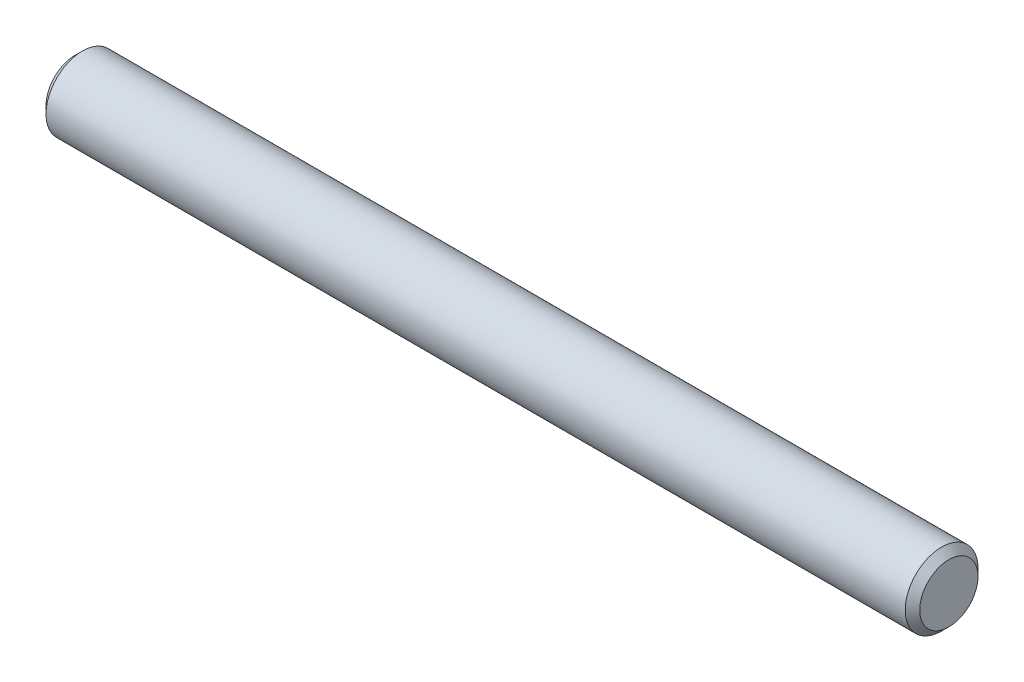
ISO-10303-21;
HEADER;
FILE_DESCRIPTION(('STEP AP214'),'2;1');
FILE_NAME('part.step','',(''),(''),'','','');
FILE_SCHEMA(('AUTOMOTIVE_DESIGN { 1 0 10303 214 1 1 1 1 }'));
ENDSEC;
DATA;
#1=APPLICATION_CONTEXT('core data for automotive mechanical design processes');
#2=APPLICATION_PROTOCOL_DEFINITION('international standard','automotive_design',2000,#1);
#3=PRODUCT_CONTEXT('',#1,'mechanical');
#4=PRODUCT('Part','Part','',(#3));
#5=PRODUCT_RELATED_PRODUCT_CATEGORY('part','',(#4));
#6=PRODUCT_DEFINITION_FORMATION('','',#4);
#7=PRODUCT_DEFINITION_CONTEXT('part definition',#1,'design');
#8=PRODUCT_DEFINITION('design','',#6,#7);
#9=PRODUCT_DEFINITION_SHAPE('','',#8);
#10=(LENGTH_UNIT() NAMED_UNIT(*) SI_UNIT(.MILLI.,.METRE.));
#11=(NAMED_UNIT(*) PLANE_ANGLE_UNIT() SI_UNIT($,.RADIAN.));
#12=(NAMED_UNIT(*) SI_UNIT($,.STERADIAN.) SOLID_ANGLE_UNIT());
#13=UNCERTAINTY_MEASURE_WITH_UNIT(LENGTH_MEASURE(1.E-05),#10,'distance_accuracy_value','');
#14=(GEOMETRIC_REPRESENTATION_CONTEXT(3) GLOBAL_UNCERTAINTY_ASSIGNED_CONTEXT((#13)) GLOBAL_UNIT_ASSIGNED_CONTEXT((#10,
#11,#12)) REPRESENTATION_CONTEXT('',''));
#15=CARTESIAN_POINT('',(0.,0.,0.));
#16=DIRECTION('',(0.,0.,1.));
#17=DIRECTION('',(1.,0.,0.));
#18=AXIS2_PLACEMENT_3D('',#15,#16,#17);
#19=CARTESIAN_POINT('',(-19.05,0.,0.));
#20=DIRECTION('',(1.,0.,0.));
#21=DIRECTION('',(0.,0.,-1.));
#22=AXIS2_PLACEMENT_3D('',#19,#20,#21);
#23=CYLINDRICAL_SURFACE('',#22,1.5875);
#24=CARTESIAN_POINT('',(18.7325,0.,0.));
#25=DIRECTION('',(1.,0.,0.));
#26=DIRECTION('',(0.,0.,-1.));
#27=AXIS2_PLACEMENT_3D('',#24,#25,#26);
#28=CIRCLE('',#27,1.5875);
#29=CARTESIAN_POINT('',(18.7325,0.,-1.5875));
#30=VERTEX_POINT('',#29);
#31=EDGE_CURVE('E37',#30,#30,#28,.F.);
#32=ORIENTED_EDGE('',*,*,#31,.T.);
#33=EDGE_LOOP('',(#32));
#34=FACE_BOUND('',#33,.T.);
#35=CARTESIAN_POINT('',(-18.7325,0.,0.));
#36=DIRECTION('',(1.,0.,0.));
#37=DIRECTION('',(0.,0.,-1.));
#38=AXIS2_PLACEMENT_3D('',#35,#36,#37);
#39=CIRCLE('',#38,1.5875);
#40=CARTESIAN_POINT('',(-18.7325,0.,-1.5875));
#41=VERTEX_POINT('',#40);
#42=EDGE_CURVE('E41',#41,#41,#39,.T.);
#43=ORIENTED_EDGE('',*,*,#42,.T.);
#44=EDGE_LOOP('',(#43));
#45=FACE_BOUND('',#44,.T.);
#46=ADVANCED_FACE('F30',(#34,#45),#23,.T.);
#47=CARTESIAN_POINT('',(-19.05,0.,0.));
#48=DIRECTION('',(1.,0.,0.));
#49=DIRECTION('',(0.,0.,-1.));
#50=AXIS2_PLACEMENT_3D('',#47,#48,#49);
#51=PLANE('',#50);
#52=CARTESIAN_POINT('',(-19.05,0.,0.));
#53=DIRECTION('',(1.,0.,0.));
#54=DIRECTION('',(0.,0.,-1.));
#55=AXIS2_PLACEMENT_3D('',#52,#53,#54);
#56=CIRCLE('',#55,1.26999999999998);
#57=CARTESIAN_POINT('',(-19.05,0.,-1.26999999999998));
#58=VERTEX_POINT('',#57);
#59=EDGE_CURVE('E10',#58,#58,#56,.F.);
#60=ORIENTED_EDGE('',*,*,#59,.T.);
#61=EDGE_LOOP('',(#60));
#62=FACE_BOUND('',#61,.T.);
#63=ADVANCED_FACE('F61',(#62),#51,.F.);
#64=CARTESIAN_POINT('',(19.05,0.,0.));
#65=DIRECTION('',(1.,0.,0.));
#66=DIRECTION('',(0.,0.,-1.));
#67=AXIS2_PLACEMENT_3D('',#64,#65,#66);
#68=PLANE('',#67);
#69=CARTESIAN_POINT('',(19.05,0.,0.));
#70=DIRECTION('',(1.,0.,0.));
#71=DIRECTION('',(0.,0.,-1.));
#72=AXIS2_PLACEMENT_3D('',#69,#70,#71);
#73=CIRCLE('',#72,1.27);
#74=CARTESIAN_POINT('',(19.05,0.,-1.27));
#75=VERTEX_POINT('',#74);
#76=EDGE_CURVE('E45',#75,#75,#73,.T.);
#77=ORIENTED_EDGE('',*,*,#76,.T.);
#78=EDGE_LOOP('',(#77));
#79=FACE_BOUND('',#78,.T.);
#80=ADVANCED_FACE('F51',(#79),#68,.T.);
#81=CARTESIAN_POINT('',(19.05,0.,0.));
#82=DIRECTION('',(-1.,0.,0.));
#83=DIRECTION('',(0.,0.,1.));
#84=AXIS2_PLACEMENT_3D('',#81,#82,#83);
#85=CONICAL_SURFACE('',#84,1.27,0.785398163397462);
#86=ORIENTED_EDGE('',*,*,#31,.F.);
#87=EDGE_LOOP('',(#86));
#88=FACE_BOUND('',#87,.T.);
#89=ORIENTED_EDGE('',*,*,#76,.F.);
#90=EDGE_LOOP('',(#89));
#91=FACE_BOUND('',#90,.T.);
#92=ADVANCED_FACE('F53',(#88,#91),#85,.T.);
#93=CARTESIAN_POINT('',(-18.7325,0.,0.));
#94=DIRECTION('',(1.,0.,0.));
#95=DIRECTION('',(0.,0.,-1.));
#96=AXIS2_PLACEMENT_3D('',#93,#94,#95);
#97=CONICAL_SURFACE('',#96,1.5875,0.785398163397445);
#98=ORIENTED_EDGE('',*,*,#59,.F.);
#99=EDGE_LOOP('',(#98));
#100=FACE_BOUND('',#99,.T.);
#101=ORIENTED_EDGE('',*,*,#42,.F.);
#102=EDGE_LOOP('',(#101));
#103=FACE_BOUND('',#102,.T.);
#104=ADVANCED_FACE('F32',(#100,#103),#97,.T.);
#105=CLOSED_SHELL('',(#46,#63,#80,#92,#104));
#106=MANIFOLD_SOLID_BREP('B2',#105);
#107=ADVANCED_BREP_SHAPE_REPRESENTATION('',(#18,#106),#14);
#108=SHAPE_DEFINITION_REPRESENTATION(#9,#107);
ENDSEC;
END-ISO-10303-21;
